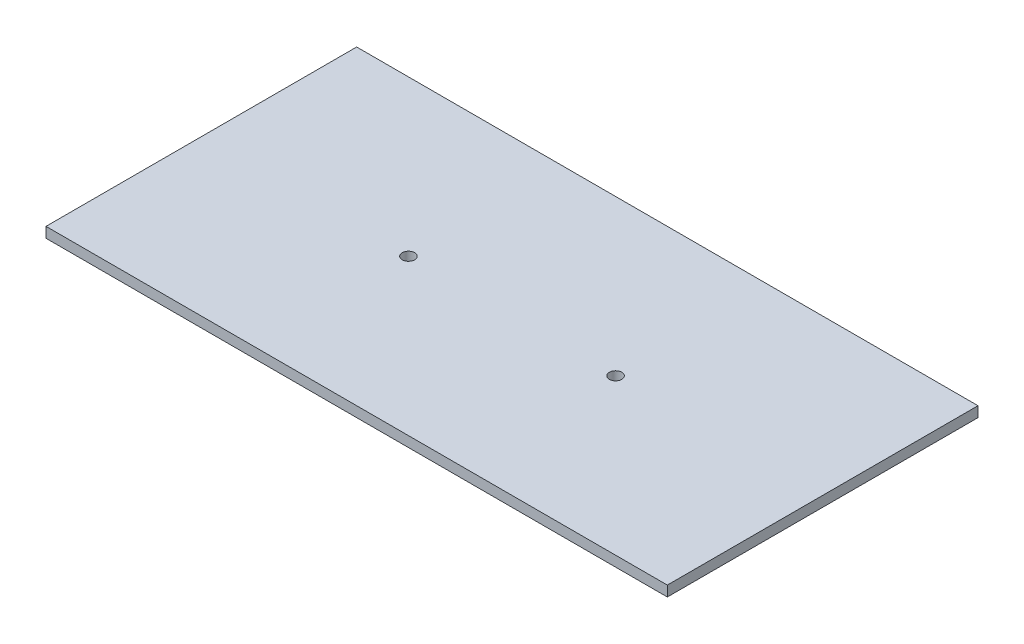
ISO-10303-21;
HEADER;
FILE_DESCRIPTION(('STEP AP214'),'2;1');
FILE_NAME('part.step','',(''),(''),'','','');
FILE_SCHEMA(('AUTOMOTIVE_DESIGN { 1 0 10303 214 1 1 1 1 }'));
ENDSEC;
DATA;
#1=APPLICATION_CONTEXT('core data for automotive mechanical design processes');
#2=APPLICATION_PROTOCOL_DEFINITION('international standard','automotive_design',2000,#1);
#3=PRODUCT_CONTEXT('',#1,'mechanical');
#4=PRODUCT('Part','Part','',(#3));
#5=PRODUCT_RELATED_PRODUCT_CATEGORY('part','',(#4));
#6=PRODUCT_DEFINITION_FORMATION('','',#4);
#7=PRODUCT_DEFINITION_CONTEXT('part definition',#1,'design');
#8=PRODUCT_DEFINITION('design','',#6,#7);
#9=PRODUCT_DEFINITION_SHAPE('','',#8);
#10=(LENGTH_UNIT() NAMED_UNIT(*) SI_UNIT(.MILLI.,.METRE.));
#11=(NAMED_UNIT(*) PLANE_ANGLE_UNIT() SI_UNIT($,.RADIAN.));
#12=(NAMED_UNIT(*) SI_UNIT($,.STERADIAN.) SOLID_ANGLE_UNIT());
#13=UNCERTAINTY_MEASURE_WITH_UNIT(LENGTH_MEASURE(1.E-05),#10,'distance_accuracy_value','');
#14=(GEOMETRIC_REPRESENTATION_CONTEXT(3) GLOBAL_UNCERTAINTY_ASSIGNED_CONTEXT((#13)) GLOBAL_UNIT_ASSIGNED_CONTEXT((#10,
#11,#12)) REPRESENTATION_CONTEXT('',''));
#15=CARTESIAN_POINT('',(0.,0.,0.));
#16=DIRECTION('',(0.,0.,1.));
#17=DIRECTION('',(1.,0.,0.));
#18=AXIS2_PLACEMENT_3D('',#15,#16,#17);
#19=CARTESIAN_POINT('',(150.,5.,75.));
#20=DIRECTION('',(-1.,0.,0.));
#21=DIRECTION('',(0.,0.,1.));
#22=AXIS2_PLACEMENT_3D('',#19,#20,#21);
#23=PLANE('',#22);
#24=DIRECTION('',(0.,0.,-1.));
#25=VECTOR('',#24,1.);
#26=CARTESIAN_POINT('',(150.,0.,75.));
#27=LINE('',#26,#25);
#28=CARTESIAN_POINT('',(150.,0.,75.));
#29=VERTEX_POINT('',#28);
#30=CARTESIAN_POINT('',(150.,0.,-75.));
#31=VERTEX_POINT('',#30);
#32=EDGE_CURVE('E97',#29,#31,#27,.T.);
#33=ORIENTED_EDGE('',*,*,#32,.T.);
#34=DIRECTION('',(0.,-1.,0.));
#35=VECTOR('',#34,1.);
#36=CARTESIAN_POINT('',(150.,5.,-75.));
#37=LINE('',#36,#35);
#38=CARTESIAN_POINT('',(150.,5.,-75.));
#39=VERTEX_POINT('',#38);
#40=EDGE_CURVE('E11',#39,#31,#37,.T.);
#41=ORIENTED_EDGE('',*,*,#40,.F.);
#42=DIRECTION('',(0.,0.,-1.));
#43=VECTOR('',#42,1.);
#44=CARTESIAN_POINT('',(150.,5.,75.));
#45=LINE('',#44,#43);
#46=CARTESIAN_POINT('',(150.,5.,75.));
#47=VERTEX_POINT('',#46);
#48=EDGE_CURVE('E85',#47,#39,#45,.T.);
#49=ORIENTED_EDGE('',*,*,#48,.F.);
#50=DIRECTION('',(0.,-1.,0.));
#51=VECTOR('',#50,1.);
#52=CARTESIAN_POINT('',(150.,5.,75.));
#53=LINE('',#52,#51);
#54=EDGE_CURVE('E93',#47,#29,#53,.T.);
#55=ORIENTED_EDGE('',*,*,#54,.T.);
#56=EDGE_LOOP('',(#33,#41,#49,#55));
#57=FACE_BOUND('',#56,.T.);
#58=ADVANCED_FACE('F34',(#57),#23,.F.);
#59=CARTESIAN_POINT('',(-150.,5.,-75.));
#60=DIRECTION('',(0.,0.,1.));
#61=DIRECTION('',(1.,0.,0.));
#62=AXIS2_PLACEMENT_3D('',#59,#60,#61);
#63=PLANE('',#62);
#64=DIRECTION('',(-1.,0.,0.));
#65=VECTOR('',#64,1.);
#66=CARTESIAN_POINT('',(-150.,0.,-75.));
#67=LINE('',#66,#65);
#68=CARTESIAN_POINT('',(-150.,0.,-75.));
#69=VERTEX_POINT('',#68);
#70=EDGE_CURVE('E89',#31,#69,#67,.T.);
#71=ORIENTED_EDGE('',*,*,#70,.T.);
#72=DIRECTION('',(0.,-1.,0.));
#73=VECTOR('',#72,1.);
#74=CARTESIAN_POINT('',(-150.,5.,-75.));
#75=LINE('',#74,#73);
#76=CARTESIAN_POINT('',(-150.,5.,-75.));
#77=VERTEX_POINT('',#76);
#78=EDGE_CURVE('E42',#77,#69,#75,.T.);
#79=ORIENTED_EDGE('',*,*,#78,.F.);
#80=DIRECTION('',(-1.,0.,0.));
#81=VECTOR('',#80,1.);
#82=CARTESIAN_POINT('',(-150.,5.,-75.));
#83=LINE('',#82,#81);
#84=EDGE_CURVE('E80',#39,#77,#83,.T.);
#85=ORIENTED_EDGE('',*,*,#84,.F.);
#86=ORIENTED_EDGE('',*,*,#40,.T.);
#87=EDGE_LOOP('',(#71,#79,#85,#86));
#88=FACE_BOUND('',#87,.T.);
#89=ADVANCED_FACE('F88',(#88),#63,.F.);
#90=CARTESIAN_POINT('',(-150.,5.,75.));
#91=DIRECTION('',(1.,0.,0.));
#92=DIRECTION('',(0.,0.,-1.));
#93=AXIS2_PLACEMENT_3D('',#90,#91,#92);
#94=PLANE('',#93);
#95=DIRECTION('',(0.,0.,1.));
#96=VECTOR('',#95,1.);
#97=CARTESIAN_POINT('',(-150.,0.,75.));
#98=LINE('',#97,#96);
#99=CARTESIAN_POINT('',(-150.,0.,75.));
#100=VERTEX_POINT('',#99);
#101=EDGE_CURVE('E67',#69,#100,#98,.T.);
#102=ORIENTED_EDGE('',*,*,#101,.T.);
#103=DIRECTION('',(0.,-1.,0.));
#104=VECTOR('',#103,1.);
#105=CARTESIAN_POINT('',(-150.,5.,75.));
#106=LINE('',#105,#104);
#107=CARTESIAN_POINT('',(-150.,5.,75.));
#108=VERTEX_POINT('',#107);
#109=EDGE_CURVE('E90',#108,#100,#106,.T.);
#110=ORIENTED_EDGE('',*,*,#109,.F.);
#111=DIRECTION('',(0.,0.,1.));
#112=VECTOR('',#111,1.);
#113=CARTESIAN_POINT('',(-150.,5.,75.));
#114=LINE('',#113,#112);
#115=EDGE_CURVE('E83',#77,#108,#114,.T.);
#116=ORIENTED_EDGE('',*,*,#115,.F.);
#117=ORIENTED_EDGE('',*,*,#78,.T.);
#118=EDGE_LOOP('',(#102,#110,#116,#117));
#119=FACE_BOUND('',#118,.T.);
#120=ADVANCED_FACE('F91',(#119),#94,.F.);
#121=CARTESIAN_POINT('',(-150.,5.,75.));
#122=DIRECTION('',(0.,0.,-1.));
#123=DIRECTION('',(-1.,0.,0.));
#124=AXIS2_PLACEMENT_3D('',#121,#122,#123);
#125=PLANE('',#124);
#126=DIRECTION('',(1.,0.,0.));
#127=VECTOR('',#126,1.);
#128=CARTESIAN_POINT('',(-150.,0.,75.));
#129=LINE('',#128,#127);
#130=EDGE_CURVE('E73',#100,#29,#129,.T.);
#131=ORIENTED_EDGE('',*,*,#130,.T.);
#132=ORIENTED_EDGE('',*,*,#54,.F.);
#133=DIRECTION('',(1.,0.,0.));
#134=VECTOR('',#133,1.);
#135=CARTESIAN_POINT('',(-150.,5.,75.));
#136=LINE('',#135,#134);
#137=EDGE_CURVE('E50',#108,#47,#136,.T.);
#138=ORIENTED_EDGE('',*,*,#137,.F.);
#139=ORIENTED_EDGE('',*,*,#109,.T.);
#140=EDGE_LOOP('',(#131,#132,#138,#139));
#141=FACE_BOUND('',#140,.T.);
#142=ADVANCED_FACE('F105',(#141),#125,.F.);
#143=CARTESIAN_POINT('',(0.,5.,0.));
#144=DIRECTION('',(0.,-1.,0.));
#145=DIRECTION('',(0.,0.,-1.));
#146=AXIS2_PLACEMENT_3D('',#143,#144,#145);
#147=PLANE('',#146);
#148=CARTESIAN_POINT('',(-50.,5.,0.));
#149=DIRECTION('',(0.,1.,0.));
#150=DIRECTION('',(0.,0.,1.));
#151=AXIS2_PLACEMENT_3D('',#148,#149,#150);
#152=CIRCLE('',#151,3.);
#153=CARTESIAN_POINT('',(-50.,5.,3.));
#154=VERTEX_POINT('',#153);
#155=EDGE_CURVE('E100',#154,#154,#152,.T.);
#156=ORIENTED_EDGE('',*,*,#155,.F.);
#157=EDGE_LOOP('',(#156));
#158=FACE_BOUND('',#157,.T.);
#159=CARTESIAN_POINT('',(50.,5.,0.));
#160=DIRECTION('',(0.,1.,0.));
#161=DIRECTION('',(0.,0.,-1.));
#162=AXIS2_PLACEMENT_3D('',#159,#160,#161);
#163=CIRCLE('',#162,3.);
#164=CARTESIAN_POINT('',(50.,5.,-3.));
#165=VERTEX_POINT('',#164);
#166=EDGE_CURVE('E114',#165,#165,#163,.T.);
#167=ORIENTED_EDGE('',*,*,#166,.F.);
#168=EDGE_LOOP('',(#167));
#169=FACE_BOUND('',#168,.T.);
#170=ORIENTED_EDGE('',*,*,#48,.T.);
#171=ORIENTED_EDGE('',*,*,#84,.T.);
#172=ORIENTED_EDGE('',*,*,#115,.T.);
#173=ORIENTED_EDGE('',*,*,#137,.T.);
#174=EDGE_LOOP('',(#170,#171,#172,#173));
#175=FACE_BOUND('',#174,.T.);
#176=ADVANCED_FACE('F81',(#158,#169,#175),#147,.F.);
#177=CARTESIAN_POINT('',(0.,0.,0.));
#178=DIRECTION('',(0.,-1.,0.));
#179=DIRECTION('',(0.,0.,-1.));
#180=AXIS2_PLACEMENT_3D('',#177,#178,#179);
#181=PLANE('',#180);
#182=CARTESIAN_POINT('',(-50.,0.,0.));
#183=DIRECTION('',(0.,-1.,0.));
#184=DIRECTION('',(0.,0.,-1.));
#185=AXIS2_PLACEMENT_3D('',#182,#183,#184);
#186=CIRCLE('',#185,3.);
#187=CARTESIAN_POINT('',(-50.,0.,-3.));
#188=VERTEX_POINT('',#187);
#189=EDGE_CURVE('E117',#188,#188,#186,.F.);
#190=ORIENTED_EDGE('',*,*,#189,.T.);
#191=EDGE_LOOP('',(#190));
#192=FACE_BOUND('',#191,.T.);
#193=CARTESIAN_POINT('',(50.,0.,0.));
#194=DIRECTION('',(0.,-1.,0.));
#195=DIRECTION('',(0.,0.,-1.));
#196=AXIS2_PLACEMENT_3D('',#193,#194,#195);
#197=CIRCLE('',#196,3.);
#198=CARTESIAN_POINT('',(50.,0.,-3.));
#199=VERTEX_POINT('',#198);
#200=EDGE_CURVE('E111',#199,#199,#197,.F.);
#201=ORIENTED_EDGE('',*,*,#200,.T.);
#202=EDGE_LOOP('',(#201));
#203=FACE_BOUND('',#202,.T.);
#204=ORIENTED_EDGE('',*,*,#32,.F.);
#205=ORIENTED_EDGE('',*,*,#130,.F.);
#206=ORIENTED_EDGE('',*,*,#101,.F.);
#207=ORIENTED_EDGE('',*,*,#70,.F.);
#208=EDGE_LOOP('',(#204,#205,#206,#207));
#209=FACE_BOUND('',#208,.T.);
#210=ADVANCED_FACE('F108',(#192,#203,#209),#181,.T.);
#211=CARTESIAN_POINT('',(50.,-0.00100000000000013,0.));
#212=DIRECTION('',(0.,1.,0.));
#213=DIRECTION('',(0.,0.,1.));
#214=AXIS2_PLACEMENT_3D('',#211,#212,#213);
#215=CYLINDRICAL_SURFACE('',#214,3.);
#216=ORIENTED_EDGE('',*,*,#200,.F.);
#217=EDGE_LOOP('',(#216));
#218=FACE_BOUND('',#217,.T.);
#219=ORIENTED_EDGE('',*,*,#166,.T.);
#220=EDGE_LOOP('',(#219));
#221=FACE_BOUND('',#220,.T.);
#222=ADVANCED_FACE('F130',(#218,#221),#215,.F.);
#223=CARTESIAN_POINT('',(-50.,-0.00100000000000013,0.));
#224=DIRECTION('',(0.,1.,0.));
#225=DIRECTION('',(0.,0.,1.));
#226=AXIS2_PLACEMENT_3D('',#223,#224,#225);
#227=CYLINDRICAL_SURFACE('',#226,3.);
#228=ORIENTED_EDGE('',*,*,#189,.F.);
#229=EDGE_LOOP('',(#228));
#230=FACE_BOUND('',#229,.T.);
#231=ORIENTED_EDGE('',*,*,#155,.T.);
#232=EDGE_LOOP('',(#231));
#233=FACE_BOUND('',#232,.T.);
#234=ADVANCED_FACE('F123',(#230,#233),#227,.F.);
#235=CLOSED_SHELL('',(#58,#89,#120,#142,#176,#210,#222,#234));
#236=MANIFOLD_SOLID_BREP('B2',#235);
#237=ADVANCED_BREP_SHAPE_REPRESENTATION('',(#18,#236),#14);
#238=SHAPE_DEFINITION_REPRESENTATION(#9,#237);
ENDSEC;
END-ISO-10303-21;
